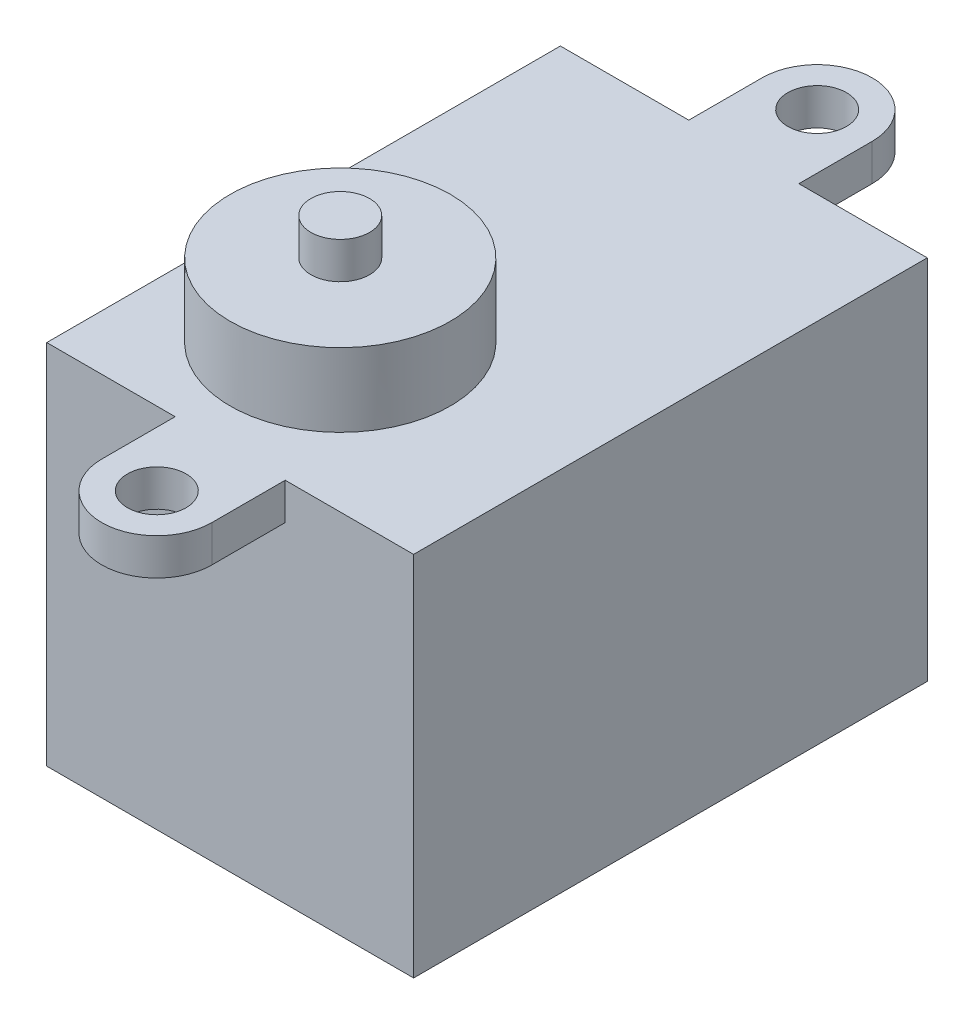
ISO-10303-21;
HEADER;
FILE_DESCRIPTION(('STEP AP214'),'2;1');
FILE_NAME('part.step','',(''),(''),'','','');
FILE_SCHEMA(('AUTOMOTIVE_DESIGN { 1 0 10303 214 1 1 1 1 }'));
ENDSEC;
DATA;
#1=APPLICATION_CONTEXT('core data for automotive mechanical design processes');
#2=APPLICATION_PROTOCOL_DEFINITION('international standard','automotive_design',2000,#1);
#3=PRODUCT_CONTEXT('',#1,'mechanical');
#4=PRODUCT('Part','Part','',(#3));
#5=PRODUCT_RELATED_PRODUCT_CATEGORY('part','',(#4));
#6=PRODUCT_DEFINITION_FORMATION('','',#4);
#7=PRODUCT_DEFINITION_CONTEXT('part definition',#1,'design');
#8=PRODUCT_DEFINITION('design','',#6,#7);
#9=PRODUCT_DEFINITION_SHAPE('','',#8);
#10=(LENGTH_UNIT() NAMED_UNIT(*) SI_UNIT(.MILLI.,.METRE.));
#11=(NAMED_UNIT(*) PLANE_ANGLE_UNIT() SI_UNIT($,.RADIAN.));
#12=(NAMED_UNIT(*) SI_UNIT($,.STERADIAN.) SOLID_ANGLE_UNIT());
#13=UNCERTAINTY_MEASURE_WITH_UNIT(LENGTH_MEASURE(1.E-05),#10,'distance_accuracy_value','');
#14=(GEOMETRIC_REPRESENTATION_CONTEXT(3) GLOBAL_UNCERTAINTY_ASSIGNED_CONTEXT((#13)) GLOBAL_UNIT_ASSIGNED_CONTEXT((#10,
#11,#12)) REPRESENTATION_CONTEXT('',''));
#15=CARTESIAN_POINT('',(0.,0.,0.));
#16=DIRECTION('',(0.,0.,1.));
#17=DIRECTION('',(1.,0.,0.));
#18=AXIS2_PLACEMENT_3D('',#15,#16,#17);
#19=CARTESIAN_POINT('',(12.3756923080972,38.9412106948704,-17.1270769242916));
#20=DIRECTION('',(0.,0.,-1.));
#21=DIRECTION('',(-1.,0.,0.));
#22=AXIS2_PLACEMENT_3D('',#19,#20,#21);
#23=PLANE('',#22);
#24=DIRECTION('',(0.,1.,0.));
#25=VECTOR('',#24,1.);
#26=CARTESIAN_POINT('',(28.6256923080972,36.4412106948704,-17.1270769242916));
#27=LINE('',#26,#25);
#28=CARTESIAN_POINT('',(28.6256923080972,36.4412106948704,-17.1270769242916));
#29=VERTEX_POINT('',#28);
#30=CARTESIAN_POINT('',(28.6256923080972,38.9412106948704,-17.1270769242916));
#31=VERTEX_POINT('',#30);
#32=EDGE_CURVE('E191',#29,#31,#27,.T.);
#33=ORIENTED_EDGE('',*,*,#32,.F.);
#34=DIRECTION('',(1.,0.,0.));
#35=VECTOR('',#34,1.);
#36=CARTESIAN_POINT('',(21.1256923080972,36.4412106948704,-17.1270769242916));
#37=LINE('',#36,#35);
#38=CARTESIAN_POINT('',(21.1256923080972,36.4412106948704,-17.1270769242916));
#39=VERTEX_POINT('',#38);
#40=EDGE_CURVE('E171',#39,#29,#37,.T.);
#41=ORIENTED_EDGE('',*,*,#40,.F.);
#42=DIRECTION('',(0.,1.,0.));
#43=VECTOR('',#42,1.);
#44=CARTESIAN_POINT('',(21.1256923080972,36.4412106948704,-17.1270769242916));
#45=LINE('',#44,#43);
#46=CARTESIAN_POINT('',(21.1256923080972,38.9412106948704,-17.1270769242916));
#47=VERTEX_POINT('',#46);
#48=EDGE_CURVE('E174',#39,#47,#45,.T.);
#49=ORIENTED_EDGE('',*,*,#48,.T.);
#50=DIRECTION('',(1.,0.,0.));
#51=VECTOR('',#50,1.);
#52=CARTESIAN_POINT('',(12.3756923080972,38.9412106948704,-17.1270769242916));
#53=LINE('',#52,#51);
#54=CARTESIAN_POINT('',(12.3756923080972,38.9412106948704,-17.1270769242916));
#55=VERTEX_POINT('',#54);
#56=EDGE_CURVE('E205',#55,#47,#53,.T.);
#57=ORIENTED_EDGE('',*,*,#56,.F.);
#58=DIRECTION('',(0.,-1.,0.));
#59=VECTOR('',#58,1.);
#60=CARTESIAN_POINT('',(12.3756923080972,38.9412106948704,-17.1270769242916));
#61=LINE('',#60,#59);
#62=CARTESIAN_POINT('',(12.3756923080972,13.9412106948704,-17.1270769242916));
#63=VERTEX_POINT('',#62);
#64=EDGE_CURVE('E275',#55,#63,#61,.T.);
#65=ORIENTED_EDGE('',*,*,#64,.T.);
#66=DIRECTION('',(1.,0.,0.));
#67=VECTOR('',#66,1.);
#68=CARTESIAN_POINT('',(12.3756923080972,13.9412106948704,-17.1270769242916));
#69=LINE('',#68,#67);
#70=CARTESIAN_POINT('',(37.3756923080972,13.9412106948704,-17.1270769242916));
#71=VERTEX_POINT('',#70);
#72=EDGE_CURVE('E289',#63,#71,#69,.T.);
#73=ORIENTED_EDGE('',*,*,#72,.T.);
#74=DIRECTION('',(0.,-1.,0.));
#75=VECTOR('',#74,1.);
#76=CARTESIAN_POINT('',(37.3756923080972,38.9412106948704,-17.1270769242916));
#77=LINE('',#76,#75);
#78=CARTESIAN_POINT('',(37.3756923080972,38.9412106948704,-17.1270769242916));
#79=VERTEX_POINT('',#78);
#80=EDGE_CURVE('E278',#79,#71,#77,.T.);
#81=ORIENTED_EDGE('',*,*,#80,.F.);
#82=EDGE_CURVE('E209',#31,#79,#53,.T.);
#83=ORIENTED_EDGE('',*,*,#82,.F.);
#84=EDGE_LOOP('',(#33,#41,#49,#57,#65,#73,#81,#83));
#85=FACE_BOUND('',#84,.T.);
#86=ADVANCED_FACE('F37',(#85),#23,.F.);
#87=CARTESIAN_POINT('',(12.3756923080972,38.9412106948704,-52.1270769242916));
#88=DIRECTION('',(0.,0.,1.));
#89=DIRECTION('',(1.,0.,0.));
#90=AXIS2_PLACEMENT_3D('',#87,#88,#89);
#91=PLANE('',#90);
#92=DIRECTION('',(0.,1.,0.));
#93=VECTOR('',#92,1.);
#94=CARTESIAN_POINT('',(21.1256923080972,36.4412106948704,-52.1270769242916));
#95=LINE('',#94,#93);
#96=CARTESIAN_POINT('',(21.1256923080972,36.4412106948704,-52.1270769242916));
#97=VERTEX_POINT('',#96);
#98=CARTESIAN_POINT('',(21.1256923080972,38.9412106948704,-52.1270769242916));
#99=VERTEX_POINT('',#98);
#100=EDGE_CURVE('E316',#97,#99,#95,.T.);
#101=ORIENTED_EDGE('',*,*,#100,.F.);
#102=DIRECTION('',(1.,0.,0.));
#103=VECTOR('',#102,1.);
#104=CARTESIAN_POINT('',(21.1256923080972,36.4412106948704,-52.1270769242916));
#105=LINE('',#104,#103);
#106=CARTESIAN_POINT('',(28.6256923080972,36.4412106948704,-52.1270769242916));
#107=VERTEX_POINT('',#106);
#108=EDGE_CURVE('E340',#97,#107,#105,.T.);
#109=ORIENTED_EDGE('',*,*,#108,.T.);
#110=DIRECTION('',(0.,1.,0.));
#111=VECTOR('',#110,1.);
#112=CARTESIAN_POINT('',(28.6256923080972,36.4412106948704,-52.1270769242916));
#113=LINE('',#112,#111);
#114=CARTESIAN_POINT('',(28.6256923080972,38.9412106948704,-52.1270769242916));
#115=VERTEX_POINT('',#114);
#116=EDGE_CURVE('E313',#107,#115,#113,.T.);
#117=ORIENTED_EDGE('',*,*,#116,.T.);
#118=DIRECTION('',(-1.,0.,0.));
#119=VECTOR('',#118,1.);
#120=CARTESIAN_POINT('',(12.3756923080972,38.9412106948704,-52.1270769242916));
#121=LINE('',#120,#119);
#122=CARTESIAN_POINT('',(37.3756923080972,38.9412106948704,-52.1270769242916));
#123=VERTEX_POINT('',#122);
#124=EDGE_CURVE('E230',#123,#115,#121,.T.);
#125=ORIENTED_EDGE('',*,*,#124,.F.);
#126=DIRECTION('',(0.,-1.,0.));
#127=VECTOR('',#126,1.);
#128=CARTESIAN_POINT('',(37.3756923080972,38.9412106948704,-52.1270769242916));
#129=LINE('',#128,#127);
#130=CARTESIAN_POINT('',(37.3756923080972,13.9412106948704,-52.1270769242916));
#131=VERTEX_POINT('',#130);
#132=EDGE_CURVE('E281',#123,#131,#129,.T.);
#133=ORIENTED_EDGE('',*,*,#132,.T.);
#134=DIRECTION('',(-1.,0.,0.));
#135=VECTOR('',#134,1.);
#136=CARTESIAN_POINT('',(12.3756923080972,13.9412106948704,-52.1270769242916));
#137=LINE('',#136,#135);
#138=CARTESIAN_POINT('',(12.3756923080972,13.9412106948704,-52.1270769242916));
#139=VERTEX_POINT('',#138);
#140=EDGE_CURVE('E286',#131,#139,#137,.T.);
#141=ORIENTED_EDGE('',*,*,#140,.T.);
#142=DIRECTION('',(0.,-1.,0.));
#143=VECTOR('',#142,1.);
#144=CARTESIAN_POINT('',(12.3756923080972,38.9412106948704,-52.1270769242916));
#145=LINE('',#144,#143);
#146=CARTESIAN_POINT('',(12.3756923080972,38.9412106948704,-52.1270769242916));
#147=VERTEX_POINT('',#146);
#148=EDGE_CURVE('E233',#147,#139,#145,.T.);
#149=ORIENTED_EDGE('',*,*,#148,.F.);
#150=EDGE_CURVE('E221',#99,#147,#121,.T.);
#151=ORIENTED_EDGE('',*,*,#150,.F.);
#152=EDGE_LOOP('',(#101,#109,#117,#125,#133,#141,#149,#151));
#153=FACE_BOUND('',#152,.T.);
#154=ADVANCED_FACE('F369',(#153),#91,.F.);
#155=CARTESIAN_POINT('',(22.3756923080972,43.9412106948704,-27.1270769242916));
#156=DIRECTION('',(0.,1.,0.));
#157=DIRECTION('',(0.,0.,1.));
#158=AXIS2_PLACEMENT_3D('',#155,#156,#157);
#159=PLANE('',#158);
#160=CARTESIAN_POINT('',(22.3756923080972,43.9412106948704,-27.1270769242916));
#161=DIRECTION('',(0.,1.,0.));
#162=DIRECTION('',(0.,0.,1.));
#163=AXIS2_PLACEMENT_3D('',#160,#161,#162);
#164=CIRCLE('',#163,7.5);
#165=CARTESIAN_POINT('',(22.3756923080972,43.9412106948704,-19.6270769242916));
#166=VERTEX_POINT('',#165);
#167=EDGE_CURVE('E293',#166,#166,#164,.T.);
#168=ORIENTED_EDGE('',*,*,#167,.T.);
#169=EDGE_LOOP('',(#168));
#170=FACE_BOUND('',#169,.T.);
#171=CARTESIAN_POINT('',(22.3756923080972,43.9412106948704,-27.1270769242916));
#172=DIRECTION('',(0.,1.,0.));
#173=DIRECTION('',(0.,0.,1.));
#174=AXIS2_PLACEMENT_3D('',#171,#172,#173);
#175=CIRCLE('',#174,2.);
#176=CARTESIAN_POINT('',(22.3756923080972,43.9412106948704,-25.1270769242916));
#177=VERTEX_POINT('',#176);
#178=EDGE_CURVE('E302',#177,#177,#175,.T.);
#179=ORIENTED_EDGE('',*,*,#178,.F.);
#180=EDGE_LOOP('',(#179));
#181=FACE_BOUND('',#180,.T.);
#182=ADVANCED_FACE('F374',(#170,#181),#159,.T.);
#183=CARTESIAN_POINT('',(12.3756923080972,38.9412106948704,-17.1270769242916));
#184=DIRECTION('',(0.,-1.,0.));
#185=DIRECTION('',(0.,0.,-1.));
#186=AXIS2_PLACEMENT_3D('',#183,#184,#185);
#187=PLANE('',#186);
#188=DIRECTION('',(0.,0.,1.));
#189=VECTOR('',#188,1.);
#190=CARTESIAN_POINT('',(12.3756923080972,38.9412106948704,-17.1270769242916));
#191=LINE('',#190,#189);
#192=EDGE_CURVE('E212',#147,#55,#191,.T.);
#193=ORIENTED_EDGE('',*,*,#192,.T.);
#194=ORIENTED_EDGE('',*,*,#56,.T.);
#195=DIRECTION('',(0.,0.,-1.));
#196=VECTOR('',#195,1.);
#197=CARTESIAN_POINT('',(21.1256923080972,38.9412106948704,-17.1270769242916));
#198=LINE('',#197,#196);
#199=CARTESIAN_POINT('',(21.1256923080972,38.9412106948704,-12.1270769242916));
#200=VERTEX_POINT('',#199);
#201=EDGE_CURVE('E55',#200,#47,#198,.T.);
#202=ORIENTED_EDGE('',*,*,#201,.F.);
#203=CARTESIAN_POINT('',(24.8756923080972,38.9412106948704,-12.1270769242916));
#204=DIRECTION('',(0.,-1.,0.));
#205=DIRECTION('',(0.,0.,-1.));
#206=AXIS2_PLACEMENT_3D('',#203,#204,#205);
#207=CIRCLE('',#206,3.75);
#208=CARTESIAN_POINT('',(28.6256923080972,38.9412106948704,-12.1270769242916));
#209=VERTEX_POINT('',#208);
#210=EDGE_CURVE('E169',#209,#200,#207,.T.);
#211=ORIENTED_EDGE('',*,*,#210,.F.);
#212=DIRECTION('',(0.,0.,1.));
#213=VECTOR('',#212,1.);
#214=CARTESIAN_POINT('',(28.6256923080972,38.9412106948704,-17.1270769242916));
#215=LINE('',#214,#213);
#216=EDGE_CURVE('E176',#31,#209,#215,.T.);
#217=ORIENTED_EDGE('',*,*,#216,.F.);
#218=ORIENTED_EDGE('',*,*,#82,.T.);
#219=DIRECTION('',(0.,0.,-1.));
#220=VECTOR('',#219,1.);
#221=CARTESIAN_POINT('',(37.3756923080972,38.9412106948704,-17.1270769242916));
#222=LINE('',#221,#220);
#223=EDGE_CURVE('E218',#79,#123,#222,.T.);
#224=ORIENTED_EDGE('',*,*,#223,.T.);
#225=ORIENTED_EDGE('',*,*,#124,.T.);
#226=DIRECTION('',(0.,0.,-1.));
#227=VECTOR('',#226,1.);
#228=CARTESIAN_POINT('',(28.6256923080972,38.9412106948704,-52.1270769242916));
#229=LINE('',#228,#227);
#230=CARTESIAN_POINT('',(28.6256923080972,38.9412106948704,-57.1270769242916));
#231=VERTEX_POINT('',#230);
#232=EDGE_CURVE('E63',#115,#231,#229,.T.);
#233=ORIENTED_EDGE('',*,*,#232,.T.);
#234=CARTESIAN_POINT('',(24.8756923080972,38.9412106948704,-57.1270769242916));
#235=DIRECTION('',(0.,1.,0.));
#236=DIRECTION('',(0.,0.,1.));
#237=AXIS2_PLACEMENT_3D('',#234,#235,#236);
#238=CIRCLE('',#237,3.75);
#239=CARTESIAN_POINT('',(21.1256923080972,38.9412106948704,-57.1270769242916));
#240=VERTEX_POINT('',#239);
#241=EDGE_CURVE('E329',#231,#240,#238,.T.);
#242=ORIENTED_EDGE('',*,*,#241,.T.);
#243=DIRECTION('',(0.,0.,1.));
#244=VECTOR('',#243,1.);
#245=CARTESIAN_POINT('',(21.1256923080972,38.9412106948704,-52.1270769242916));
#246=LINE('',#245,#244);
#247=EDGE_CURVE('E322',#240,#99,#246,.T.);
#248=ORIENTED_EDGE('',*,*,#247,.T.);
#249=ORIENTED_EDGE('',*,*,#150,.T.);
#250=EDGE_LOOP('',(#193,#194,#202,#211,#217,#218,#224,#225,#233,#242,#248,#249));
#251=FACE_BOUND('',#250,.T.);
#252=CARTESIAN_POINT('',(22.3756923080972,38.9412106948704,-27.1270769242916));
#253=DIRECTION('',(0.,-1.,0.));
#254=DIRECTION('',(0.,0.,-1.));
#255=AXIS2_PLACEMENT_3D('',#252,#253,#254);
#256=CIRCLE('',#255,7.5);
#257=CARTESIAN_POINT('',(22.3756923080972,38.9412106948704,-34.6270769242916));
#258=VERTEX_POINT('',#257);
#259=EDGE_CURVE('E238',#258,#258,#256,.F.);
#260=ORIENTED_EDGE('',*,*,#259,.F.);
#261=EDGE_LOOP('',(#260));
#262=FACE_BOUND('',#261,.T.);
#263=CARTESIAN_POINT('',(24.8756923080972,38.9412106948704,-57.1270769242916));
#264=DIRECTION('',(0.,1.,0.));
#265=DIRECTION('',(0.,0.,1.));
#266=AXIS2_PLACEMENT_3D('',#263,#264,#265);
#267=CIRCLE('',#266,2.);
#268=CARTESIAN_POINT('',(24.8756923080972,38.9412106948704,-55.1270769242916));
#269=VERTEX_POINT('',#268);
#270=EDGE_CURVE('E190',#269,#269,#267,.T.);
#271=ORIENTED_EDGE('',*,*,#270,.F.);
#272=EDGE_LOOP('',(#271));
#273=FACE_BOUND('',#272,.T.);
#274=CARTESIAN_POINT('',(24.8756923080972,38.9412106948704,-12.1270769242916));
#275=DIRECTION('',(0.,-1.,0.));
#276=DIRECTION('',(0.,0.,-1.));
#277=AXIS2_PLACEMENT_3D('',#274,#275,#276);
#278=CIRCLE('',#277,2.);
#279=CARTESIAN_POINT('',(24.8756923080972,38.9412106948704,-14.1270769242916));
#280=VERTEX_POINT('',#279);
#281=EDGE_CURVE('E179',#280,#280,#278,.T.);
#282=ORIENTED_EDGE('',*,*,#281,.T.);
#283=EDGE_LOOP('',(#282));
#284=FACE_BOUND('',#283,.T.);
#285=ADVANCED_FACE('F201',(#251,#262,#273,#284),#187,.F.);
#286=CARTESIAN_POINT('',(12.3756923080972,38.9412106948704,-17.1270769242916));
#287=DIRECTION('',(1.,0.,0.));
#288=DIRECTION('',(0.,0.,-1.));
#289=AXIS2_PLACEMENT_3D('',#286,#287,#288);
#290=PLANE('',#289);
#291=DIRECTION('',(0.,0.,1.));
#292=VECTOR('',#291,1.);
#293=CARTESIAN_POINT('',(12.3756923080972,13.9412106948704,-17.1270769242916));
#294=LINE('',#293,#292);
#295=EDGE_CURVE('E224',#139,#63,#294,.T.);
#296=ORIENTED_EDGE('',*,*,#295,.T.);
#297=ORIENTED_EDGE('',*,*,#64,.F.);
#298=ORIENTED_EDGE('',*,*,#192,.F.);
#299=ORIENTED_EDGE('',*,*,#148,.T.);
#300=EDGE_LOOP('',(#296,#297,#298,#299));
#301=FACE_BOUND('',#300,.T.);
#302=ADVANCED_FACE('F380',(#301),#290,.F.);
#303=CARTESIAN_POINT('',(37.3756923080972,38.9412106948704,-17.1270769242916));
#304=DIRECTION('',(-1.,0.,0.));
#305=DIRECTION('',(0.,0.,1.));
#306=AXIS2_PLACEMENT_3D('',#303,#304,#305);
#307=PLANE('',#306);
#308=DIRECTION('',(0.,0.,-1.));
#309=VECTOR('',#308,1.);
#310=CARTESIAN_POINT('',(37.3756923080972,13.9412106948704,-17.1270769242916));
#311=LINE('',#310,#309);
#312=EDGE_CURVE('E288',#71,#131,#311,.T.);
#313=ORIENTED_EDGE('',*,*,#312,.T.);
#314=ORIENTED_EDGE('',*,*,#132,.F.);
#315=ORIENTED_EDGE('',*,*,#223,.F.);
#316=ORIENTED_EDGE('',*,*,#80,.T.);
#317=EDGE_LOOP('',(#313,#314,#315,#316));
#318=FACE_BOUND('',#317,.T.);
#319=ADVANCED_FACE('F379',(#318),#307,.F.);
#320=CARTESIAN_POINT('',(12.3756923080972,13.9412106948704,-17.1270769242916));
#321=DIRECTION('',(0.,-1.,0.));
#322=DIRECTION('',(0.,0.,-1.));
#323=AXIS2_PLACEMENT_3D('',#320,#321,#322);
#324=PLANE('',#323);
#325=ORIENTED_EDGE('',*,*,#295,.F.);
#326=ORIENTED_EDGE('',*,*,#140,.F.);
#327=ORIENTED_EDGE('',*,*,#312,.F.);
#328=ORIENTED_EDGE('',*,*,#72,.F.);
#329=EDGE_LOOP('',(#325,#326,#327,#328));
#330=FACE_BOUND('',#329,.T.);
#331=ADVANCED_FACE('F590',(#330),#324,.T.);
#332=CARTESIAN_POINT('',(22.3756923080972,43.9412106948704,-27.1270769242916));
#333=DIRECTION('',(0.,-1.,0.));
#334=DIRECTION('',(0.,0.,-1.));
#335=AXIS2_PLACEMENT_3D('',#332,#333,#334);
#336=CYLINDRICAL_SURFACE('',#335,7.5);
#337=ORIENTED_EDGE('',*,*,#167,.F.);
#338=EDGE_LOOP('',(#337));
#339=FACE_BOUND('',#338,.T.);
#340=ORIENTED_EDGE('',*,*,#259,.T.);
#341=EDGE_LOOP('',(#340));
#342=FACE_BOUND('',#341,.T.);
#343=ADVANCED_FACE('F579',(#339,#342),#336,.T.);
#344=CARTESIAN_POINT('',(22.3756923080972,46.4412106948704,-27.1270769242916));
#345=DIRECTION('',(0.,-1.,0.));
#346=DIRECTION('',(0.,0.,-1.));
#347=AXIS2_PLACEMENT_3D('',#344,#345,#346);
#348=CYLINDRICAL_SURFACE('',#347,2.);
#349=CARTESIAN_POINT('',(22.3756923080972,46.4412106948704,-27.1270769242916));
#350=DIRECTION('',(0.,1.,0.));
#351=DIRECTION('',(0.,0.,1.));
#352=AXIS2_PLACEMENT_3D('',#349,#350,#351);
#353=CIRCLE('',#352,2.);
#354=CARTESIAN_POINT('',(22.3756923080972,46.4412106948704,-25.1270769242916));
#355=VERTEX_POINT('',#354);
#356=EDGE_CURVE('E298',#355,#355,#353,.T.);
#357=ORIENTED_EDGE('',*,*,#356,.F.);
#358=EDGE_LOOP('',(#357));
#359=FACE_BOUND('',#358,.T.);
#360=ORIENTED_EDGE('',*,*,#178,.T.);
#361=EDGE_LOOP('',(#360));
#362=FACE_BOUND('',#361,.T.);
#363=ADVANCED_FACE('F569',(#359,#362),#348,.T.);
#364=CARTESIAN_POINT('',(22.3756923080972,46.4412106948704,-27.1270769242916));
#365=DIRECTION('',(0.,1.,0.));
#366=DIRECTION('',(0.,0.,1.));
#367=AXIS2_PLACEMENT_3D('',#364,#365,#366);
#368=PLANE('',#367);
#369=ORIENTED_EDGE('',*,*,#356,.T.);
#370=EDGE_LOOP('',(#369));
#371=FACE_BOUND('',#370,.T.);
#372=ADVANCED_FACE('F364',(#371),#368,.T.);
#373=CARTESIAN_POINT('',(21.1256923080972,36.4412106948704,-52.1270769242916));
#374=DIRECTION('',(-1.,0.,0.));
#375=DIRECTION('',(0.,0.,1.));
#376=AXIS2_PLACEMENT_3D('',#373,#374,#375);
#377=PLANE('',#376);
#378=ORIENTED_EDGE('',*,*,#247,.F.);
#379=DIRECTION('',(0.,1.,0.));
#380=VECTOR('',#379,1.);
#381=CARTESIAN_POINT('',(21.1256923080972,36.4412106948704,-57.1270769242916));
#382=LINE('',#381,#380);
#383=CARTESIAN_POINT('',(21.1256923080972,36.4412106948704,-57.1270769242916));
#384=VERTEX_POINT('',#383);
#385=EDGE_CURVE('E306',#384,#240,#382,.T.);
#386=ORIENTED_EDGE('',*,*,#385,.F.);
#387=DIRECTION('',(0.,0.,1.));
#388=VECTOR('',#387,1.);
#389=CARTESIAN_POINT('',(21.1256923080972,36.4412106948704,-52.1270769242916));
#390=LINE('',#389,#388);
#391=EDGE_CURVE('E337',#384,#97,#390,.T.);
#392=ORIENTED_EDGE('',*,*,#391,.T.);
#393=ORIENTED_EDGE('',*,*,#100,.T.);
#394=EDGE_LOOP('',(#378,#386,#392,#393));
#395=FACE_BOUND('',#394,.T.);
#396=ADVANCED_FACE('F356',(#395),#377,.T.);
#397=CARTESIAN_POINT('',(24.8756923080972,36.4412106948704,-57.1270769242916));
#398=DIRECTION('',(0.,1.,0.));
#399=DIRECTION('',(0.,0.,1.));
#400=AXIS2_PLACEMENT_3D('',#397,#398,#399);
#401=CYLINDRICAL_SURFACE('',#400,3.75);
#402=ORIENTED_EDGE('',*,*,#241,.F.);
#403=DIRECTION('',(0.,1.,0.));
#404=VECTOR('',#403,1.);
#405=CARTESIAN_POINT('',(28.6256923080972,36.4412106948704,-57.1270769242916));
#406=LINE('',#405,#404);
#407=CARTESIAN_POINT('',(28.6256923080972,36.4412106948704,-57.1270769242916));
#408=VERTEX_POINT('',#407);
#409=EDGE_CURVE('E310',#408,#231,#406,.T.);
#410=ORIENTED_EDGE('',*,*,#409,.F.);
#411=CARTESIAN_POINT('',(24.8756923080972,36.4412106948704,-57.1270769242916));
#412=DIRECTION('',(0.,1.,0.));
#413=DIRECTION('',(0.,0.,1.));
#414=AXIS2_PLACEMENT_3D('',#411,#412,#413);
#415=CIRCLE('',#414,3.75);
#416=EDGE_CURVE('E319',#408,#384,#415,.T.);
#417=ORIENTED_EDGE('',*,*,#416,.T.);
#418=ORIENTED_EDGE('',*,*,#385,.T.);
#419=EDGE_LOOP('',(#402,#410,#417,#418));
#420=FACE_BOUND('',#419,.T.);
#421=ADVANCED_FACE('F354',(#420),#401,.T.);
#422=CARTESIAN_POINT('',(28.6256923080972,36.4412106948704,-52.1270769242916));
#423=DIRECTION('',(1.,0.,0.));
#424=DIRECTION('',(0.,0.,-1.));
#425=AXIS2_PLACEMENT_3D('',#422,#423,#424);
#426=PLANE('',#425);
#427=ORIENTED_EDGE('',*,*,#232,.F.);
#428=ORIENTED_EDGE('',*,*,#116,.F.);
#429=DIRECTION('',(0.,0.,-1.));
#430=VECTOR('',#429,1.);
#431=CARTESIAN_POINT('',(28.6256923080972,36.4412106948704,-52.1270769242916));
#432=LINE('',#431,#430);
#433=EDGE_CURVE('E343',#107,#408,#432,.T.);
#434=ORIENTED_EDGE('',*,*,#433,.T.);
#435=ORIENTED_EDGE('',*,*,#409,.T.);
#436=EDGE_LOOP('',(#427,#428,#434,#435));
#437=FACE_BOUND('',#436,.T.);
#438=ADVANCED_FACE('F350',(#437),#426,.T.);
#439=CARTESIAN_POINT('',(24.8756923080972,36.4412106948704,-57.1270769242916));
#440=DIRECTION('',(0.,1.,0.));
#441=DIRECTION('',(0.,0.,1.));
#442=AXIS2_PLACEMENT_3D('',#439,#440,#441);
#443=PLANE('',#442);
#444=CARTESIAN_POINT('',(24.8756923080972,36.4412106948704,-57.1270769242916));
#445=DIRECTION('',(0.,1.,0.));
#446=DIRECTION('',(0.,0.,1.));
#447=AXIS2_PLACEMENT_3D('',#444,#445,#446);
#448=CIRCLE('',#447,2.);
#449=CARTESIAN_POINT('',(24.8756923080972,36.4412106948704,-55.1270769242916));
#450=VERTEX_POINT('',#449);
#451=EDGE_CURVE('E324',#450,#450,#448,.T.);
#452=ORIENTED_EDGE('',*,*,#451,.T.);
#453=EDGE_LOOP('',(#452));
#454=FACE_BOUND('',#453,.T.);
#455=ORIENTED_EDGE('',*,*,#391,.F.);
#456=ORIENTED_EDGE('',*,*,#416,.F.);
#457=ORIENTED_EDGE('',*,*,#433,.F.);
#458=ORIENTED_EDGE('',*,*,#108,.F.);
#459=EDGE_LOOP('',(#455,#456,#457,#458));
#460=FACE_BOUND('',#459,.T.);
#461=ADVANCED_FACE('F362',(#454,#460),#443,.F.);
#462=CARTESIAN_POINT('',(24.8756923080972,36.4412106948704,-57.1270769242916));
#463=DIRECTION('',(0.,1.,0.));
#464=DIRECTION('',(0.,0.,1.));
#465=AXIS2_PLACEMENT_3D('',#462,#463,#464);
#466=CYLINDRICAL_SURFACE('',#465,2.);
#467=ORIENTED_EDGE('',*,*,#451,.F.);
#468=EDGE_LOOP('',(#467));
#469=FACE_BOUND('',#468,.T.);
#470=ORIENTED_EDGE('',*,*,#270,.T.);
#471=EDGE_LOOP('',(#470));
#472=FACE_BOUND('',#471,.T.);
#473=ADVANCED_FACE('F526',(#469,#472),#466,.F.);
#474=CARTESIAN_POINT('',(24.8756923080972,36.4412106948704,-12.1270769242916));
#475=DIRECTION('',(0.,1.,0.));
#476=DIRECTION('',(0.,0.,-1.));
#477=AXIS2_PLACEMENT_3D('',#474,#475,#476);
#478=PLANE('',#477);
#479=DIRECTION('',(0.,0.,-1.));
#480=VECTOR('',#479,1.);
#481=CARTESIAN_POINT('',(21.1256923080972,36.4412106948704,-17.1270769242916));
#482=LINE('',#481,#480);
#483=CARTESIAN_POINT('',(21.1256923080972,36.4412106948704,-12.1270769242916));
#484=VERTEX_POINT('',#483);
#485=EDGE_CURVE('E159',#484,#39,#482,.T.);
#486=ORIENTED_EDGE('',*,*,#485,.T.);
#487=ORIENTED_EDGE('',*,*,#40,.T.);
#488=DIRECTION('',(0.,0.,1.));
#489=VECTOR('',#488,1.);
#490=CARTESIAN_POINT('',(28.6256923080972,36.4412106948704,-17.1270769242916));
#491=LINE('',#490,#489);
#492=CARTESIAN_POINT('',(28.6256923080972,36.4412106948704,-12.1270769242916));
#493=VERTEX_POINT('',#492);
#494=EDGE_CURVE('E161',#29,#493,#491,.T.);
#495=ORIENTED_EDGE('',*,*,#494,.T.);
#496=CARTESIAN_POINT('',(24.8756923080972,36.4412106948704,-12.1270769242916));
#497=DIRECTION('',(0.,-1.,0.));
#498=DIRECTION('',(0.,0.,-1.));
#499=AXIS2_PLACEMENT_3D('',#496,#497,#498);
#500=CIRCLE('',#499,3.75);
#501=EDGE_CURVE('E154',#493,#484,#500,.T.);
#502=ORIENTED_EDGE('',*,*,#501,.T.);
#503=EDGE_LOOP('',(#486,#487,#495,#502));
#504=FACE_BOUND('',#503,.T.);
#505=CARTESIAN_POINT('',(24.8756923080972,36.4412106948704,-12.1270769242916));
#506=DIRECTION('',(0.,-1.,0.));
#507=DIRECTION('',(0.,0.,-1.));
#508=AXIS2_PLACEMENT_3D('',#505,#506,#507);
#509=CIRCLE('',#508,2.);
#510=CARTESIAN_POINT('',(24.8756923080972,36.4412106948704,-14.1270769242916));
#511=VERTEX_POINT('',#510);
#512=EDGE_CURVE('E206',#511,#511,#509,.T.);
#513=ORIENTED_EDGE('',*,*,#512,.F.);
#514=EDGE_LOOP('',(#513));
#515=FACE_BOUND('',#514,.T.);
#516=ADVANCED_FACE('F156',(#504,#515),#478,.F.);
#517=CARTESIAN_POINT('',(21.1256923080972,36.4412106948704,-17.1270769242916));
#518=DIRECTION('',(1.,0.,0.));
#519=DIRECTION('',(0.,0.,-1.));
#520=AXIS2_PLACEMENT_3D('',#517,#518,#519);
#521=PLANE('',#520);
#522=ORIENTED_EDGE('',*,*,#201,.T.);
#523=ORIENTED_EDGE('',*,*,#48,.F.);
#524=ORIENTED_EDGE('',*,*,#485,.F.);
#525=DIRECTION('',(0.,1.,0.));
#526=VECTOR('',#525,1.);
#527=CARTESIAN_POINT('',(21.1256923080972,36.4412106948704,-12.1270769242916));
#528=LINE('',#527,#526);
#529=EDGE_CURVE('E166',#484,#200,#528,.T.);
#530=ORIENTED_EDGE('',*,*,#529,.T.);
#531=EDGE_LOOP('',(#522,#523,#524,#530));
#532=FACE_BOUND('',#531,.T.);
#533=ADVANCED_FACE('F173',(#532),#521,.F.);
#534=CARTESIAN_POINT('',(28.6256923080972,36.4412106948704,-17.1270769242916));
#535=DIRECTION('',(-1.,0.,0.));
#536=DIRECTION('',(0.,0.,1.));
#537=AXIS2_PLACEMENT_3D('',#534,#535,#536);
#538=PLANE('',#537);
#539=ORIENTED_EDGE('',*,*,#216,.T.);
#540=DIRECTION('',(0.,1.,0.));
#541=VECTOR('',#540,1.);
#542=CARTESIAN_POINT('',(28.6256923080972,36.4412106948704,-12.1270769242916));
#543=LINE('',#542,#541);
#544=EDGE_CURVE('E170',#493,#209,#543,.T.);
#545=ORIENTED_EDGE('',*,*,#544,.F.);
#546=ORIENTED_EDGE('',*,*,#494,.F.);
#547=ORIENTED_EDGE('',*,*,#32,.T.);
#548=EDGE_LOOP('',(#539,#545,#546,#547));
#549=FACE_BOUND('',#548,.T.);
#550=ADVANCED_FACE('F501',(#549),#538,.F.);
#551=CARTESIAN_POINT('',(24.8756923080972,36.4412106948704,-12.1270769242916));
#552=DIRECTION('',(0.,1.,0.));
#553=DIRECTION('',(0.,0.,1.));
#554=AXIS2_PLACEMENT_3D('',#551,#552,#553);
#555=CYLINDRICAL_SURFACE('',#554,3.75);
#556=ORIENTED_EDGE('',*,*,#210,.T.);
#557=ORIENTED_EDGE('',*,*,#529,.F.);
#558=ORIENTED_EDGE('',*,*,#501,.F.);
#559=ORIENTED_EDGE('',*,*,#544,.T.);
#560=EDGE_LOOP('',(#556,#557,#558,#559));
#561=FACE_BOUND('',#560,.T.);
#562=ADVANCED_FACE('F167',(#561),#555,.T.);
#563=CARTESIAN_POINT('',(24.8756923080972,36.4412106948704,-12.1270769242916));
#564=DIRECTION('',(0.,1.,0.));
#565=DIRECTION('',(0.,0.,1.));
#566=AXIS2_PLACEMENT_3D('',#563,#564,#565);
#567=CYLINDRICAL_SURFACE('',#566,2.);
#568=ORIENTED_EDGE('',*,*,#512,.T.);
#569=EDGE_LOOP('',(#568));
#570=FACE_BOUND('',#569,.T.);
#571=ORIENTED_EDGE('',*,*,#281,.F.);
#572=EDGE_LOOP('',(#571));
#573=FACE_BOUND('',#572,.T.);
#574=ADVANCED_FACE('F488',(#570,#573),#567,.F.);
#575=CLOSED_SHELL('',(#86,#154,#182,#285,#302,#319,#331,#343,#363,#372,#396,#421,#438,#461,#473,
#516,#533,#550,#562,#574));
#576=CARTESIAN_POINT('',(22.3756923080972,42.9412106948704,-27.1270769242916));
#577=DIRECTION('',(0.,1.,0.));
#578=DIRECTION('',(0.,0.,1.));
#579=AXIS2_PLACEMENT_3D('',#576,#577,#578);
#580=PLANE('',#579);
#581=CARTESIAN_POINT('',(22.3756923080972,42.9412106948704,-27.1270769242916));
#582=DIRECTION('',(0.,1.,0.));
#583=DIRECTION('',(0.,0.,1.));
#584=AXIS2_PLACEMENT_3D('',#581,#582,#583);
#585=CIRCLE('',#584,6.5);
#586=CARTESIAN_POINT('',(22.3756923080972,42.9412106948704,-20.6270769242916));
#587=VERTEX_POINT('',#586);
#588=EDGE_CURVE('E234',#587,#587,#585,.T.);
#589=ORIENTED_EDGE('',*,*,#588,.F.);
#590=EDGE_LOOP('',(#589));
#591=FACE_BOUND('',#590,.T.);
#592=CARTESIAN_POINT('',(22.3756923080972,42.9412106948704,-27.1270769242916));
#593=DIRECTION('',(0.,1.,0.));
#594=DIRECTION('',(0.,0.,1.));
#595=AXIS2_PLACEMENT_3D('',#592,#593,#594);
#596=CIRCLE('',#595,1.);
#597=CARTESIAN_POINT('',(22.3756923080972,42.9412106948704,-26.1270769242916));
#598=VERTEX_POINT('',#597);
#599=EDGE_CURVE('E47',#598,#598,#596,.T.);
#600=ORIENTED_EDGE('',*,*,#599,.T.);
#601=EDGE_LOOP('',(#600));
#602=FACE_BOUND('',#601,.T.);
#603=ADVANCED_FACE('F383',(#591,#602),#580,.F.);
#604=CARTESIAN_POINT('',(12.3756923080972,37.9412106948704,-17.1270769242916));
#605=DIRECTION('',(0.,-1.,0.));
#606=DIRECTION('',(0.,0.,-1.));
#607=AXIS2_PLACEMENT_3D('',#604,#605,#606);
#608=PLANE('',#607);
#609=DIRECTION('',(0.,0.,1.));
#610=VECTOR('',#609,1.);
#611=CARTESIAN_POINT('',(13.3756923080972,37.9412106948704,-17.1270769242916));
#612=LINE('',#611,#610);
#613=CARTESIAN_POINT('',(13.3756923080972,37.9412106948704,-51.1270769242916));
#614=VERTEX_POINT('',#613);
#615=CARTESIAN_POINT('',(13.3756923080972,37.9412106948704,-18.1270769242916));
#616=VERTEX_POINT('',#615);
#617=EDGE_CURVE('E237',#614,#616,#612,.T.);
#618=ORIENTED_EDGE('',*,*,#617,.F.);
#619=DIRECTION('',(-1.,0.,0.));
#620=VECTOR('',#619,1.);
#621=CARTESIAN_POINT('',(12.3756923080972,37.9412106948704,-51.1270769242916));
#622=LINE('',#621,#620);
#623=CARTESIAN_POINT('',(36.3756923080972,37.9412106948704,-51.1270769242916));
#624=VERTEX_POINT('',#623);
#625=EDGE_CURVE('E245',#624,#614,#622,.T.);
#626=ORIENTED_EDGE('',*,*,#625,.F.);
#627=DIRECTION('',(0.,0.,-1.));
#628=VECTOR('',#627,1.);
#629=CARTESIAN_POINT('',(36.3756923080972,37.9412106948704,-17.1270769242916));
#630=LINE('',#629,#628);
#631=CARTESIAN_POINT('',(36.3756923080972,37.9412106948704,-18.1270769242916));
#632=VERTEX_POINT('',#631);
#633=EDGE_CURVE('E243',#632,#624,#630,.T.);
#634=ORIENTED_EDGE('',*,*,#633,.F.);
#635=DIRECTION('',(1.,0.,0.));
#636=VECTOR('',#635,1.);
#637=CARTESIAN_POINT('',(12.3756923080972,37.9412106948704,-18.1270769242916));
#638=LINE('',#637,#636);
#639=EDGE_CURVE('E241',#616,#632,#638,.T.);
#640=ORIENTED_EDGE('',*,*,#639,.F.);
#641=EDGE_LOOP('',(#618,#626,#634,#640));
#642=FACE_BOUND('',#641,.T.);
#643=CARTESIAN_POINT('',(22.3756923080972,37.9412106948704,-27.1270769242916));
#644=DIRECTION('',(0.,-1.,0.));
#645=DIRECTION('',(0.,0.,-1.));
#646=AXIS2_PLACEMENT_3D('',#643,#644,#645);
#647=CIRCLE('',#646,6.5);
#648=CARTESIAN_POINT('',(22.3756923080972,37.9412106948704,-33.6270769242916));
#649=VERTEX_POINT('',#648);
#650=EDGE_CURVE('E268',#649,#649,#647,.F.);
#651=ORIENTED_EDGE('',*,*,#650,.T.);
#652=EDGE_LOOP('',(#651));
#653=FACE_BOUND('',#652,.T.);
#654=ADVANCED_FACE('F386',(#642,#653),#608,.T.);
#655=CARTESIAN_POINT('',(13.3756923080972,38.9412106948704,-17.1270769242916));
#656=DIRECTION('',(1.,0.,0.));
#657=DIRECTION('',(0.,0.,-1.));
#658=AXIS2_PLACEMENT_3D('',#655,#656,#657);
#659=PLANE('',#658);
#660=DIRECTION('',(0.,0.,1.));
#661=VECTOR('',#660,1.);
#662=CARTESIAN_POINT('',(13.3756923080972,14.9412106948704,-17.1270769242916));
#663=LINE('',#662,#661);
#664=CARTESIAN_POINT('',(13.3756923080972,14.9412106948704,-51.1270769242916));
#665=VERTEX_POINT('',#664);
#666=CARTESIAN_POINT('',(13.3756923080972,14.9412106948704,-18.1270769242916));
#667=VERTEX_POINT('',#666);
#668=EDGE_CURVE('E247',#665,#667,#663,.T.);
#669=ORIENTED_EDGE('',*,*,#668,.F.);
#670=DIRECTION('',(0.,-1.,0.));
#671=VECTOR('',#670,1.);
#672=CARTESIAN_POINT('',(13.3756923080972,38.9412106948704,-51.1270769242916));
#673=LINE('',#672,#671);
#674=EDGE_CURVE('E250',#614,#665,#673,.T.);
#675=ORIENTED_EDGE('',*,*,#674,.F.);
#676=ORIENTED_EDGE('',*,*,#617,.T.);
#677=DIRECTION('',(0.,-1.,0.));
#678=VECTOR('',#677,1.);
#679=CARTESIAN_POINT('',(13.3756923080972,38.9412106948704,-18.1270769242916));
#680=LINE('',#679,#678);
#681=EDGE_CURVE('E255',#616,#667,#680,.T.);
#682=ORIENTED_EDGE('',*,*,#681,.T.);
#683=EDGE_LOOP('',(#669,#675,#676,#682));
#684=FACE_BOUND('',#683,.T.);
#685=ADVANCED_FACE('F391',(#684),#659,.T.);
#686=CARTESIAN_POINT('',(12.3756923080972,38.9412106948704,-18.1270769242916));
#687=DIRECTION('',(0.,0.,-1.));
#688=DIRECTION('',(-1.,0.,0.));
#689=AXIS2_PLACEMENT_3D('',#686,#687,#688);
#690=PLANE('',#689);
#691=DIRECTION('',(1.,0.,0.));
#692=VECTOR('',#691,1.);
#693=CARTESIAN_POINT('',(12.3756923080972,14.9412106948704,-18.1270769242916));
#694=LINE('',#693,#692);
#695=CARTESIAN_POINT('',(36.3756923080972,14.9412106948704,-18.1270769242916));
#696=VERTEX_POINT('',#695);
#697=EDGE_CURVE('E253',#667,#696,#694,.T.);
#698=ORIENTED_EDGE('',*,*,#697,.F.);
#699=ORIENTED_EDGE('',*,*,#681,.F.);
#700=ORIENTED_EDGE('',*,*,#639,.T.);
#701=DIRECTION('',(0.,-1.,0.));
#702=VECTOR('',#701,1.);
#703=CARTESIAN_POINT('',(36.3756923080972,38.9412106948704,-18.1270769242916));
#704=LINE('',#703,#702);
#705=EDGE_CURVE('E260',#632,#696,#704,.T.);
#706=ORIENTED_EDGE('',*,*,#705,.T.);
#707=EDGE_LOOP('',(#698,#699,#700,#706));
#708=FACE_BOUND('',#707,.T.);
#709=ADVANCED_FACE('F395',(#708),#690,.T.);
#710=CARTESIAN_POINT('',(36.3756923080972,38.9412106948704,-17.1270769242916));
#711=DIRECTION('',(-1.,0.,0.));
#712=DIRECTION('',(0.,0.,1.));
#713=AXIS2_PLACEMENT_3D('',#710,#711,#712);
#714=PLANE('',#713);
#715=DIRECTION('',(0.,0.,-1.));
#716=VECTOR('',#715,1.);
#717=CARTESIAN_POINT('',(36.3756923080972,14.9412106948704,-17.1270769242916));
#718=LINE('',#717,#716);
#719=CARTESIAN_POINT('',(36.3756923080972,14.9412106948704,-51.1270769242916));
#720=VERTEX_POINT('',#719);
#721=EDGE_CURVE('E258',#696,#720,#718,.T.);
#722=ORIENTED_EDGE('',*,*,#721,.F.);
#723=ORIENTED_EDGE('',*,*,#705,.F.);
#724=ORIENTED_EDGE('',*,*,#633,.T.);
#725=DIRECTION('',(0.,-1.,0.));
#726=VECTOR('',#725,1.);
#727=CARTESIAN_POINT('',(36.3756923080972,38.9412106948704,-51.1270769242916));
#728=LINE('',#727,#726);
#729=EDGE_CURVE('E265',#624,#720,#728,.T.);
#730=ORIENTED_EDGE('',*,*,#729,.T.);
#731=EDGE_LOOP('',(#722,#723,#724,#730));
#732=FACE_BOUND('',#731,.T.);
#733=ADVANCED_FACE('F399',(#732),#714,.T.);
#734=CARTESIAN_POINT('',(12.3756923080972,38.9412106948704,-51.1270769242916));
#735=DIRECTION('',(0.,0.,1.));
#736=DIRECTION('',(1.,0.,0.));
#737=AXIS2_PLACEMENT_3D('',#734,#735,#736);
#738=PLANE('',#737);
#739=DIRECTION('',(-1.,0.,0.));
#740=VECTOR('',#739,1.);
#741=CARTESIAN_POINT('',(12.3756923080972,14.9412106948704,-51.1270769242916));
#742=LINE('',#741,#740);
#743=EDGE_CURVE('E263',#720,#665,#742,.T.);
#744=ORIENTED_EDGE('',*,*,#743,.F.);
#745=ORIENTED_EDGE('',*,*,#729,.F.);
#746=ORIENTED_EDGE('',*,*,#625,.T.);
#747=ORIENTED_EDGE('',*,*,#674,.T.);
#748=EDGE_LOOP('',(#744,#745,#746,#747));
#749=FACE_BOUND('',#748,.T.);
#750=ADVANCED_FACE('F403',(#749),#738,.T.);
#751=CARTESIAN_POINT('',(12.3756923080972,14.9412106948704,-17.1270769242916));
#752=DIRECTION('',(0.,-1.,0.));
#753=DIRECTION('',(0.,0.,-1.));
#754=AXIS2_PLACEMENT_3D('',#751,#752,#753);
#755=PLANE('',#754);
#756=ORIENTED_EDGE('',*,*,#668,.T.);
#757=ORIENTED_EDGE('',*,*,#697,.T.);
#758=ORIENTED_EDGE('',*,*,#721,.T.);
#759=ORIENTED_EDGE('',*,*,#743,.T.);
#760=EDGE_LOOP('',(#756,#757,#758,#759));
#761=FACE_BOUND('',#760,.T.);
#762=ADVANCED_FACE('F407',(#761),#755,.F.);
#763=CARTESIAN_POINT('',(22.3756923080972,43.9412106948704,-27.1270769242916));
#764=DIRECTION('',(0.,-1.,0.));
#765=DIRECTION('',(0.,0.,-1.));
#766=AXIS2_PLACEMENT_3D('',#763,#764,#765);
#767=CYLINDRICAL_SURFACE('',#766,6.5);
#768=ORIENTED_EDGE('',*,*,#588,.T.);
#769=EDGE_LOOP('',(#768));
#770=FACE_BOUND('',#769,.T.);
#771=ORIENTED_EDGE('',*,*,#650,.F.);
#772=EDGE_LOOP('',(#771));
#773=FACE_BOUND('',#772,.T.);
#774=ADVANCED_FACE('F411',(#770,#773),#767,.F.);
#775=CARTESIAN_POINT('',(22.3756923080972,46.4412106948704,-27.1270769242916));
#776=DIRECTION('',(0.,-1.,0.));
#777=DIRECTION('',(0.,0.,-1.));
#778=AXIS2_PLACEMENT_3D('',#775,#776,#777);
#779=CYLINDRICAL_SURFACE('',#778,1.);
#780=CARTESIAN_POINT('',(22.3756923080972,45.4412106948704,-27.1270769242916));
#781=DIRECTION('',(0.,1.,0.));
#782=DIRECTION('',(0.,0.,1.));
#783=AXIS2_PLACEMENT_3D('',#780,#781,#782);
#784=CIRCLE('',#783,1.);
#785=CARTESIAN_POINT('',(22.3756923080972,45.4412106948704,-26.1270769242916));
#786=VERTEX_POINT('',#785);
#787=EDGE_CURVE('E11',#786,#786,#784,.T.);
#788=ORIENTED_EDGE('',*,*,#787,.T.);
#789=EDGE_LOOP('',(#788));
#790=FACE_BOUND('',#789,.T.);
#791=ORIENTED_EDGE('',*,*,#599,.F.);
#792=EDGE_LOOP('',(#791));
#793=FACE_BOUND('',#792,.T.);
#794=ADVANCED_FACE('F414',(#790,#793),#779,.F.);
#795=CARTESIAN_POINT('',(22.3756923080972,45.4412106948704,-27.1270769242916));
#796=DIRECTION('',(0.,1.,0.));
#797=DIRECTION('',(0.,0.,1.));
#798=AXIS2_PLACEMENT_3D('',#795,#796,#797);
#799=PLANE('',#798);
#800=ORIENTED_EDGE('',*,*,#787,.F.);
#801=EDGE_LOOP('',(#800));
#802=FACE_BOUND('',#801,.T.);
#803=ADVANCED_FACE('F39',(#802),#799,.F.);
#804=CLOSED_SHELL('',(#603,#654,#685,#709,#733,#750,#762,#774,#794,#803));
#805=ORIENTED_CLOSED_SHELL('',*,#804,.T.);
#806=BREP_WITH_VOIDS('B2',#575,(#805));
#807=ADVANCED_BREP_SHAPE_REPRESENTATION('',(#18,#806),#14);
#808=SHAPE_DEFINITION_REPRESENTATION(#9,#807);
ENDSEC;
END-ISO-10303-21;
